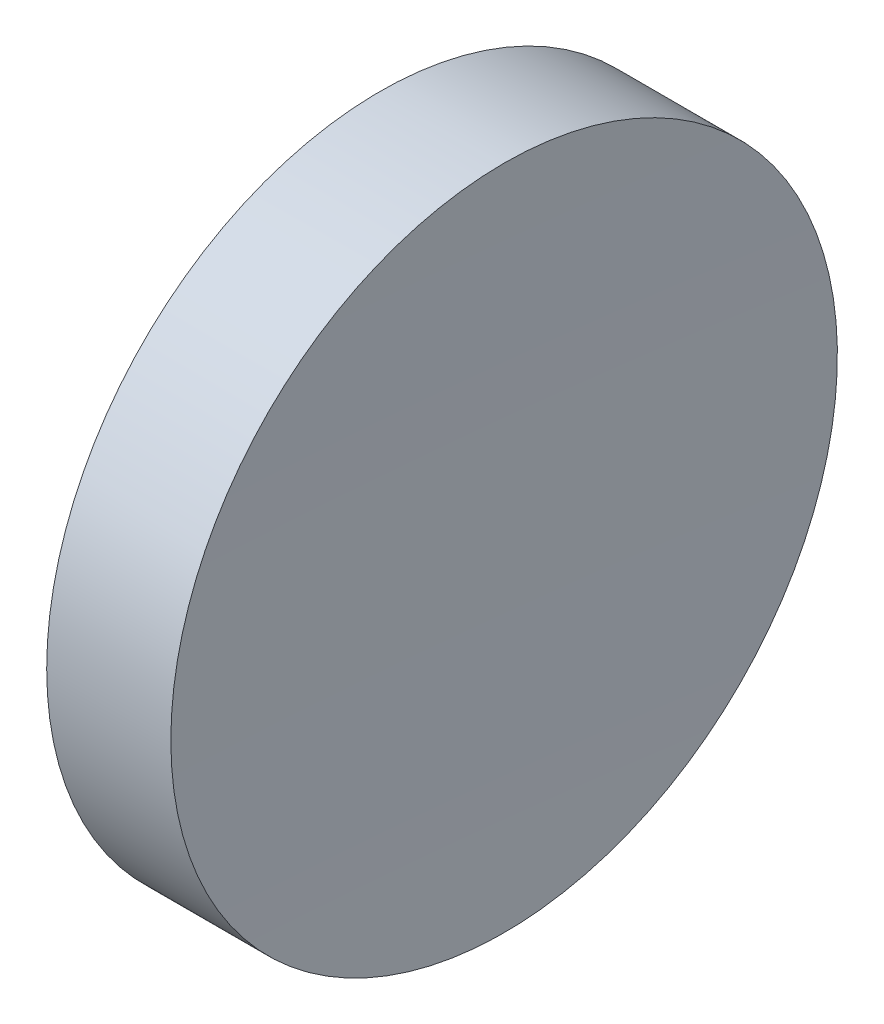
ISO-10303-21;
HEADER;
FILE_DESCRIPTION(('STEP AP214'),'2;1');
FILE_NAME('part.step','',(''),(''),'','','');
FILE_SCHEMA(('AUTOMOTIVE_DESIGN { 1 0 10303 214 1 1 1 1 }'));
ENDSEC;
DATA;
#1=APPLICATION_CONTEXT('core data for automotive mechanical design processes');
#2=APPLICATION_PROTOCOL_DEFINITION('international standard','automotive_design',2000,#1);
#3=PRODUCT_CONTEXT('',#1,'mechanical');
#4=PRODUCT('Part','Part','',(#3));
#5=PRODUCT_RELATED_PRODUCT_CATEGORY('part','',(#4));
#6=PRODUCT_DEFINITION_FORMATION('','',#4);
#7=PRODUCT_DEFINITION_CONTEXT('part definition',#1,'design');
#8=PRODUCT_DEFINITION('design','',#6,#7);
#9=PRODUCT_DEFINITION_SHAPE('','',#8);
#10=(LENGTH_UNIT() NAMED_UNIT(*) SI_UNIT(.MILLI.,.METRE.));
#11=(NAMED_UNIT(*) PLANE_ANGLE_UNIT() SI_UNIT($,.RADIAN.));
#12=(NAMED_UNIT(*) SI_UNIT($,.STERADIAN.) SOLID_ANGLE_UNIT());
#13=UNCERTAINTY_MEASURE_WITH_UNIT(LENGTH_MEASURE(1.E-05),#10,'distance_accuracy_value','');
#14=(GEOMETRIC_REPRESENTATION_CONTEXT(3) GLOBAL_UNCERTAINTY_ASSIGNED_CONTEXT((#13)) GLOBAL_UNIT_ASSIGNED_CONTEXT((#10,
#11,#12)) REPRESENTATION_CONTEXT('',''));
#15=CARTESIAN_POINT('',(0.,0.,0.));
#16=DIRECTION('',(0.,0.,1.));
#17=DIRECTION('',(1.,0.,0.));
#18=AXIS2_PLACEMENT_3D('',#15,#16,#17);
#19=CARTESIAN_POINT('',(1239.1853100151,138.756042246743,0.));
#20=DIRECTION('',(-1.,0.,0.));
#21=DIRECTION('',(0.,1.,0.));
#22=AXIS2_PLACEMENT_3D('',#19,#20,#21);
#23=SPHERICAL_SURFACE('',#22,1000.);
#24=CARTESIAN_POINT('',(239.497858858493,138.756042246745,0.));
#25=DIRECTION('',(-1.,0.,0.));
#26=DIRECTION('',(0.,0.,1.));
#27=AXIS2_PLACEMENT_3D('',#24,#25,#26);
#28=CIRCLE('',#27,25.);
#29=CARTESIAN_POINT('',(239.497858858493,138.756042246745,25.));
#30=VERTEX_POINT('',#29);
#31=EDGE_CURVE('E10',#30,#30,#28,.T.);
#32=ORIENTED_EDGE('',*,*,#31,.F.);
#33=EDGE_LOOP('',(#32));
#34=FACE_BOUND('',#33,.T.);
#35=ADVANCED_FACE('F35',(#34),#23,.F.);
#36=CARTESIAN_POINT('',(217.97028600433,138.756042246745,0.));
#37=DIRECTION('',(-1.,0.,0.));
#38=DIRECTION('',(0.,0.,1.));
#39=AXIS2_PLACEMENT_3D('',#36,#37,#38);
#40=CYLINDRICAL_SURFACE('',#39,25.);
#41=CARTESIAN_POINT('',(230.185311069839,138.756042246745,0.));
#42=DIRECTION('',(-1.,0.,0.));
#43=DIRECTION('',(0.,0.,1.));
#44=AXIS2_PLACEMENT_3D('',#41,#42,#43);
#45=CIRCLE('',#44,25.);
#46=CARTESIAN_POINT('',(230.185311069839,138.756042246745,25.));
#47=VERTEX_POINT('',#46);
#48=EDGE_CURVE('E41',#47,#47,#45,.T.);
#49=ORIENTED_EDGE('',*,*,#48,.F.);
#50=EDGE_LOOP('',(#49));
#51=FACE_BOUND('',#50,.T.);
#52=ORIENTED_EDGE('',*,*,#31,.T.);
#53=EDGE_LOOP('',(#52));
#54=FACE_BOUND('',#53,.T.);
#55=ADVANCED_FACE('F49',(#51,#54),#40,.T.);
#56=CARTESIAN_POINT('',(230.185311069839,138.756042246745,0.));
#57=DIRECTION('',(1.,0.,0.));
#58=DIRECTION('',(0.,0.,-1.));
#59=AXIS2_PLACEMENT_3D('',#56,#57,#58);
#60=PLANE('',#59);
#61=ORIENTED_EDGE('',*,*,#48,.T.);
#62=EDGE_LOOP('',(#61));
#63=FACE_BOUND('',#62,.T.);
#64=ADVANCED_FACE('F47',(#63),#60,.F.);
#65=CLOSED_SHELL('',(#35,#55,#64));
#66=MANIFOLD_SOLID_BREP('B2',#65);
#67=ADVANCED_BREP_SHAPE_REPRESENTATION('',(#18,#66),#14);
#68=SHAPE_DEFINITION_REPRESENTATION(#9,#67);
ENDSEC;
END-ISO-10303-21;
